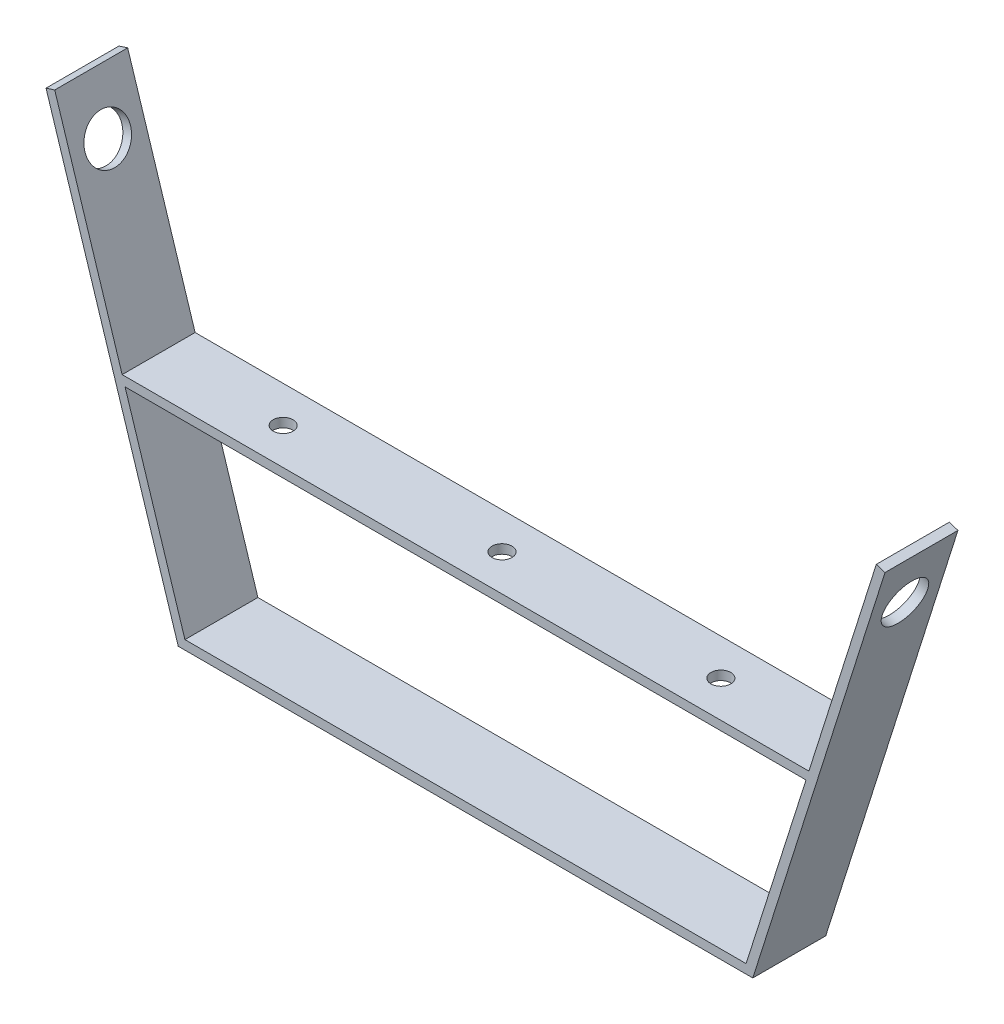
ISO-10303-21;
HEADER;
FILE_DESCRIPTION(('STEP AP214'),'2;1');
FILE_NAME('part.step','',(''),(''),'','','');
FILE_SCHEMA(('AUTOMOTIVE_DESIGN { 1 0 10303 214 1 1 1 1 }'));
ENDSEC;
DATA;
#1=APPLICATION_CONTEXT('core data for automotive mechanical design processes');
#2=APPLICATION_PROTOCOL_DEFINITION('international standard','automotive_design',2000,#1);
#3=PRODUCT_CONTEXT('',#1,'mechanical');
#4=PRODUCT('Part','Part','',(#3));
#5=PRODUCT_RELATED_PRODUCT_CATEGORY('part','',(#4));
#6=PRODUCT_DEFINITION_FORMATION('','',#4);
#7=PRODUCT_DEFINITION_CONTEXT('part definition',#1,'design');
#8=PRODUCT_DEFINITION('design','',#6,#7);
#9=PRODUCT_DEFINITION_SHAPE('','',#8);
#10=(LENGTH_UNIT() NAMED_UNIT(*) SI_UNIT(.MILLI.,.METRE.));
#11=(NAMED_UNIT(*) PLANE_ANGLE_UNIT() SI_UNIT($,.RADIAN.));
#12=(NAMED_UNIT(*) SI_UNIT($,.STERADIAN.) SOLID_ANGLE_UNIT());
#13=UNCERTAINTY_MEASURE_WITH_UNIT(LENGTH_MEASURE(1.E-05),#10,'distance_accuracy_value','');
#14=(GEOMETRIC_REPRESENTATION_CONTEXT(3) GLOBAL_UNCERTAINTY_ASSIGNED_CONTEXT((#13)) GLOBAL_UNIT_ASSIGNED_CONTEXT((#10,
#11,#12)) REPRESENTATION_CONTEXT('',''));
#15=CARTESIAN_POINT('',(0.,0.,0.));
#16=DIRECTION('',(0.,0.,1.));
#17=DIRECTION('',(1.,0.,0.));
#18=AXIS2_PLACEMENT_3D('',#15,#16,#17);
#19=CARTESIAN_POINT('',(101.785788592537,-21.2759063930494,25.4));
#20=DIRECTION('',(0.953281521756413,-0.302083333333333,0.));
#21=DIRECTION('',(0.302083333333333,0.953281521756413,0.));
#22=AXIS2_PLACEMENT_3D('',#19,#20,#21);
#23=PLANE('',#22);
#24=CARTESIAN_POINT('',(141.366413923611,103.628299116502,12.7));
#25=DIRECTION('',(0.953281521756413,-0.302083333333333,0.));
#26=DIRECTION('',(0.302083333333333,0.953281521756413,0.));
#27=AXIS2_PLACEMENT_3D('',#24,#25,#26);
#28=CIRCLE('',#27,7.93749999999999);
#29=CARTESIAN_POINT('',(143.764200381944,111.194971195443,12.7));
#30=VERTEX_POINT('',#29);
#31=EDGE_CURVE('E42',#30,#30,#28,.T.);
#32=ORIENTED_EDGE('',*,*,#31,.T.);
#33=EDGE_LOOP('',(#32));
#34=FACE_BOUND('',#33,.T.);
#35=DIRECTION('',(-0.302083333333333,-0.953281521756413,0.));
#36=VECTOR('',#35,1.);
#37=CARTESIAN_POINT('',(101.785788592537,-21.2759063930494,0.));
#38=LINE('',#37,#36);
#39=CARTESIAN_POINT('',(147.121101423611,121.788312105961,0.));
#40=VERTEX_POINT('',#39);
#41=CARTESIAN_POINT('',(123.641976423611,47.6954591089659,0.));
#42=VERTEX_POINT('',#41);
#43=EDGE_CURVE('E144',#40,#42,#38,.T.);
#44=ORIENTED_EDGE('',*,*,#43,.T.);
#45=DIRECTION('',(0.,0.,-1.));
#46=VECTOR('',#45,1.);
#47=CARTESIAN_POINT('',(123.641976423611,47.6954591089659,25.4));
#48=LINE('',#47,#46);
#49=CARTESIAN_POINT('',(123.641976423611,47.6954591089659,25.4));
#50=VERTEX_POINT('',#49);
#51=EDGE_CURVE('E173',#50,#42,#48,.T.);
#52=ORIENTED_EDGE('',*,*,#51,.F.);
#53=DIRECTION('',(-0.302083333333333,-0.953281521756413,0.));
#54=VECTOR('',#53,1.);
#55=CARTESIAN_POINT('',(101.785788592537,-21.2759063930494,25.4));
#56=LINE('',#55,#54);
#57=CARTESIAN_POINT('',(147.121101423611,121.788312105961,25.4));
#58=VERTEX_POINT('',#57);
#59=EDGE_CURVE('E205',#58,#50,#56,.T.);
#60=ORIENTED_EDGE('',*,*,#59,.F.);
#61=DIRECTION('',(0.,0.,-1.));
#62=VECTOR('',#61,1.);
#63=CARTESIAN_POINT('',(147.121101423611,121.788312105961,25.4));
#64=LINE('',#63,#62);
#65=EDGE_CURVE('E254',#58,#40,#64,.T.);
#66=ORIENTED_EDGE('',*,*,#65,.T.);
#67=EDGE_LOOP('',(#44,#52,#60,#66));
#68=FACE_BOUND('',#67,.T.);
#69=ADVANCED_FACE('F38',(#34,#68),#23,.F.);
#70=CARTESIAN_POINT('',(-93.5902480821614,-21.2759063930494,25.4));
#71=DIRECTION('',(-0.953281521756413,-0.302083333333333,0.));
#72=DIRECTION('',(0.302083333333333,-0.953281521756413,0.));
#73=AXIS2_PLACEMENT_3D('',#70,#71,#72);
#74=PLANE('',#73);
#75=CARTESIAN_POINT('',(-133.170873413236,103.628299116502,12.7));
#76=DIRECTION('',(-0.953281521756413,-0.302083333333333,0.));
#77=DIRECTION('',(0.302083333333333,-0.953281521756413,0.));
#78=AXIS2_PLACEMENT_3D('',#75,#76,#77);
#79=CIRCLE('',#78,7.9375);
#80=CARTESIAN_POINT('',(-130.773086954902,96.0616270375601,12.7));
#81=VERTEX_POINT('',#80);
#82=EDGE_CURVE('E190',#81,#81,#79,.T.);
#83=ORIENTED_EDGE('',*,*,#82,.T.);
#84=EDGE_LOOP('',(#83));
#85=FACE_BOUND('',#84,.T.);
#86=DIRECTION('',(-0.302083333333333,0.953281521756413,0.));
#87=VECTOR('',#86,1.);
#88=CARTESIAN_POINT('',(-93.5902480821614,-21.2759063930494,25.4));
#89=LINE('',#88,#87);
#90=CARTESIAN_POINT('',(-115.446435913236,47.6954591089659,25.4));
#91=VERTEX_POINT('',#90);
#92=CARTESIAN_POINT('',(-138.925560913236,121.788312105961,25.4));
#93=VERTEX_POINT('',#92);
#94=EDGE_CURVE('E56',#91,#93,#89,.T.);
#95=ORIENTED_EDGE('',*,*,#94,.F.);
#96=DIRECTION('',(0.,0.,-1.));
#97=VECTOR('',#96,1.);
#98=CARTESIAN_POINT('',(-115.446435913236,47.6954591089659,25.4));
#99=LINE('',#98,#97);
#100=CARTESIAN_POINT('',(-115.446435913236,47.6954591089659,0.));
#101=VERTEX_POINT('',#100);
#102=EDGE_CURVE('E178',#91,#101,#99,.T.);
#103=ORIENTED_EDGE('',*,*,#102,.T.);
#104=DIRECTION('',(-0.302083333333333,0.953281521756413,0.));
#105=VECTOR('',#104,1.);
#106=CARTESIAN_POINT('',(-93.5902480821614,-21.2759063930494,0.));
#107=LINE('',#106,#105);
#108=CARTESIAN_POINT('',(-138.925560913236,121.788312105961,0.));
#109=VERTEX_POINT('',#108);
#110=EDGE_CURVE('E234',#101,#109,#107,.T.);
#111=ORIENTED_EDGE('',*,*,#110,.T.);
#112=DIRECTION('',(0.,0.,-1.));
#113=VECTOR('',#112,1.);
#114=CARTESIAN_POINT('',(-138.925560913236,121.788312105961,25.4));
#115=LINE('',#114,#113);
#116=EDGE_CURVE('E243',#93,#109,#115,.T.);
#117=ORIENTED_EDGE('',*,*,#116,.F.);
#118=EDGE_LOOP('',(#95,#103,#111,#117));
#119=FACE_BOUND('',#118,.T.);
#120=ADVANCED_FACE('F268',(#85,#119),#74,.F.);
#121=CARTESIAN_POINT('',(-95.9147297448123,-24.4509063930494,25.4));
#122=DIRECTION('',(0.953281521756413,0.302083333333333,0.));
#123=DIRECTION('',(-0.302083333333333,0.953281521756413,0.));
#124=AXIS2_PLACEMENT_3D('',#121,#122,#123);
#125=PLANE('',#124);
#126=CARTESIAN_POINT('',(-136.197542244812,102.669184533168,12.7));
#127=DIRECTION('',(-0.953281521756413,-0.302083333333333,0.));
#128=DIRECTION('',(0.302083333333333,-0.953281521756413,0.));
#129=AXIS2_PLACEMENT_3D('',#126,#127,#128);
#130=CIRCLE('',#129,7.9375);
#131=CARTESIAN_POINT('',(-133.799755786479,95.1025124542268,12.7));
#132=VERTEX_POINT('',#131);
#133=EDGE_CURVE('E186',#132,#132,#130,.T.);
#134=ORIENTED_EDGE('',*,*,#133,.F.);
#135=EDGE_LOOP('',(#134));
#136=FACE_BOUND('',#135,.T.);
#137=DIRECTION('',(0.302083333333333,-0.953281521756413,0.));
#138=VECTOR('',#137,1.);
#139=CARTESIAN_POINT('',(-95.9147297448123,-24.4509063930494,0.));
#140=LINE('',#139,#138);
#141=CARTESIAN_POINT('',(-141.952229744812,120.829197522628,0.));
#142=VERTEX_POINT('',#141);
#143=CARTESIAN_POINT('',(-95.9147297448123,-24.4509063930494,0.));
#144=VERTEX_POINT('',#143);
#145=EDGE_CURVE('E219',#142,#144,#140,.T.);
#146=ORIENTED_EDGE('',*,*,#145,.T.);
#147=DIRECTION('',(0.,0.,-1.));
#148=VECTOR('',#147,1.);
#149=CARTESIAN_POINT('',(-95.9147297448123,-24.4509063930494,25.4));
#150=LINE('',#149,#148);
#151=CARTESIAN_POINT('',(-95.9147297448123,-24.4509063930494,25.4));
#152=VERTEX_POINT('',#151);
#153=EDGE_CURVE('E11',#152,#144,#150,.T.);
#154=ORIENTED_EDGE('',*,*,#153,.F.);
#155=DIRECTION('',(0.302083333333333,-0.953281521756413,0.));
#156=VECTOR('',#155,1.);
#157=CARTESIAN_POINT('',(-95.9147297448123,-24.4509063930494,25.4));
#158=LINE('',#157,#156);
#159=CARTESIAN_POINT('',(-141.952229744812,120.829197522628,25.4));
#160=VERTEX_POINT('',#159);
#161=EDGE_CURVE('E191',#160,#152,#158,.T.);
#162=ORIENTED_EDGE('',*,*,#161,.F.);
#163=DIRECTION('',(0.,0.,-1.));
#164=VECTOR('',#163,1.);
#165=CARTESIAN_POINT('',(-141.952229744812,120.829197522628,25.4));
#166=LINE('',#165,#164);
#167=EDGE_CURVE('E218',#160,#142,#166,.T.);
#168=ORIENTED_EDGE('',*,*,#167,.T.);
#169=EDGE_LOOP('',(#146,#154,#162,#168));
#170=FACE_BOUND('',#169,.T.);
#171=ADVANCED_FACE('F40',(#136,#170),#125,.F.);
#172=CARTESIAN_POINT('',(-95.9147297448123,-24.4509063930494,25.4));
#173=DIRECTION('',(0.,1.,0.));
#174=DIRECTION('',(-1.,0.,0.));
#175=AXIS2_PLACEMENT_3D('',#172,#173,#174);
#176=PLANE('',#175);
#177=DIRECTION('',(1.,0.,0.));
#178=VECTOR('',#177,1.);
#179=CARTESIAN_POINT('',(-95.9147297448123,-24.4509063930494,0.));
#180=LINE('',#179,#178);
#181=CARTESIAN_POINT('',(104.110270255188,-24.4509063930494,0.));
#182=VERTEX_POINT('',#181);
#183=EDGE_CURVE('E223',#144,#182,#180,.T.);
#184=ORIENTED_EDGE('',*,*,#183,.T.);
#185=DIRECTION('',(0.,0.,-1.));
#186=VECTOR('',#185,1.);
#187=CARTESIAN_POINT('',(104.110270255188,-24.4509063930494,25.4));
#188=LINE('',#187,#186);
#189=CARTESIAN_POINT('',(104.110270255188,-24.4509063930494,25.4));
#190=VERTEX_POINT('',#189);
#191=EDGE_CURVE('E48',#190,#182,#188,.T.);
#192=ORIENTED_EDGE('',*,*,#191,.F.);
#193=DIRECTION('',(1.,0.,0.));
#194=VECTOR('',#193,1.);
#195=CARTESIAN_POINT('',(-95.9147297448123,-24.4509063930494,25.4));
#196=LINE('',#195,#194);
#197=EDGE_CURVE('E195',#152,#190,#196,.T.);
#198=ORIENTED_EDGE('',*,*,#197,.F.);
#199=ORIENTED_EDGE('',*,*,#153,.T.);
#200=EDGE_LOOP('',(#184,#192,#198,#199));
#201=FACE_BOUND('',#200,.T.);
#202=ADVANCED_FACE('F313',(#201),#176,.F.);
#203=CARTESIAN_POINT('',(104.110270255188,-24.4509063930494,25.4));
#204=DIRECTION('',(-0.953281521756413,0.302083333333333,0.));
#205=DIRECTION('',(-0.302083333333333,-0.953281521756413,0.));
#206=AXIS2_PLACEMENT_3D('',#203,#204,#205);
#207=PLANE('',#206);
#208=CARTESIAN_POINT('',(144.393082755188,102.669184533168,12.7));
#209=DIRECTION('',(0.953281521756413,-0.302083333333333,0.));
#210=DIRECTION('',(0.302083333333333,0.953281521756413,0.));
#211=AXIS2_PLACEMENT_3D('',#208,#209,#210);
#212=CIRCLE('',#211,7.93749999999999);
#213=CARTESIAN_POINT('',(146.790869213521,110.23585661211,12.7));
#214=VERTEX_POINT('',#213);
#215=EDGE_CURVE('E177',#214,#214,#212,.T.);
#216=ORIENTED_EDGE('',*,*,#215,.F.);
#217=EDGE_LOOP('',(#216));
#218=FACE_BOUND('',#217,.T.);
#219=DIRECTION('',(0.302083333333333,0.953281521756413,0.));
#220=VECTOR('',#219,1.);
#221=CARTESIAN_POINT('',(104.110270255188,-24.4509063930494,0.));
#222=LINE('',#221,#220);
#223=CARTESIAN_POINT('',(150.147770255188,120.829197522628,0.));
#224=VERTEX_POINT('',#223);
#225=EDGE_CURVE('E226',#182,#224,#222,.T.);
#226=ORIENTED_EDGE('',*,*,#225,.T.);
#227=DIRECTION('',(0.,0.,-1.));
#228=VECTOR('',#227,1.);
#229=CARTESIAN_POINT('',(150.147770255188,120.829197522628,25.4));
#230=LINE('',#229,#228);
#231=CARTESIAN_POINT('',(150.147770255188,120.829197522628,25.4));
#232=VERTEX_POINT('',#231);
#233=EDGE_CURVE('E258',#232,#224,#230,.T.);
#234=ORIENTED_EDGE('',*,*,#233,.F.);
#235=DIRECTION('',(0.302083333333333,0.953281521756413,0.));
#236=VECTOR('',#235,1.);
#237=CARTESIAN_POINT('',(104.110270255188,-24.4509063930494,25.4));
#238=LINE('',#237,#236);
#239=EDGE_CURVE('E199',#190,#232,#238,.T.);
#240=ORIENTED_EDGE('',*,*,#239,.F.);
#241=ORIENTED_EDGE('',*,*,#191,.T.);
#242=EDGE_LOOP('',(#226,#234,#240,#241));
#243=FACE_BOUND('',#242,.T.);
#244=ADVANCED_FACE('F308',(#218,#243),#207,.F.);
#245=CARTESIAN_POINT('',(147.121101423611,121.788312105961,25.4));
#246=DIRECTION('',(-0.302083333333333,-0.953281521756413,0.));
#247=DIRECTION('',(0.953281521756413,-0.302083333333333,0.));
#248=AXIS2_PLACEMENT_3D('',#245,#246,#247);
#249=PLANE('',#248);
#250=DIRECTION('',(-0.953281521756413,0.302083333333333,0.));
#251=VECTOR('',#250,1.);
#252=CARTESIAN_POINT('',(147.121101423611,121.788312105961,0.));
#253=LINE('',#252,#251);
#254=EDGE_CURVE('E145',#224,#40,#253,.T.);
#255=ORIENTED_EDGE('',*,*,#254,.T.);
#256=ORIENTED_EDGE('',*,*,#65,.F.);
#257=DIRECTION('',(-0.953281521756413,0.302083333333333,0.));
#258=VECTOR('',#257,1.);
#259=CARTESIAN_POINT('',(147.121101423611,121.788312105961,25.4));
#260=LINE('',#259,#258);
#261=EDGE_CURVE('E202',#232,#58,#260,.T.);
#262=ORIENTED_EDGE('',*,*,#261,.F.);
#263=ORIENTED_EDGE('',*,*,#233,.T.);
#264=EDGE_LOOP('',(#255,#256,#262,#263));
#265=FACE_BOUND('',#264,.T.);
#266=ADVANCED_FACE('F301',(#265),#249,.F.);
#267=CARTESIAN_POINT('',(122.635857495001,44.5204591089659,25.4));
#268=VERTEX_POINT('',#267);
#269=CARTESIAN_POINT('',(101.785788592537,-21.2759063930494,25.4));
#270=VERTEX_POINT('',#269);
#271=EDGE_CURVE('E150',#268,#270,#56,.T.);
#272=ORIENTED_EDGE('',*,*,#271,.F.);
#273=DIRECTION('',(0.,0.,-1.));
#274=VECTOR('',#273,1.);
#275=CARTESIAN_POINT('',(122.635857495001,44.5204591089659,25.4));
#276=LINE('',#275,#274);
#277=CARTESIAN_POINT('',(122.635857495001,44.5204591089659,0.));
#278=VERTEX_POINT('',#277);
#279=EDGE_CURVE('E148',#268,#278,#276,.T.);
#280=ORIENTED_EDGE('',*,*,#279,.T.);
#281=CARTESIAN_POINT('',(101.785788592537,-21.2759063930494,0.));
#282=VERTEX_POINT('',#281);
#283=EDGE_CURVE('E132',#278,#282,#38,.T.);
#284=ORIENTED_EDGE('',*,*,#283,.T.);
#285=DIRECTION('',(0.,0.,-1.));
#286=VECTOR('',#285,1.);
#287=CARTESIAN_POINT('',(101.785788592537,-21.2759063930494,25.4));
#288=LINE('',#287,#286);
#289=EDGE_CURVE('E251',#270,#282,#288,.T.);
#290=ORIENTED_EDGE('',*,*,#289,.F.);
#291=EDGE_LOOP('',(#272,#280,#284,#290));
#292=FACE_BOUND('',#291,.T.);
#293=ADVANCED_FACE('F149',(#292),#23,.F.);
#294=CARTESIAN_POINT('',(-93.5902480821614,-21.2759063930494,25.4));
#295=DIRECTION('',(0.,-1.,0.));
#296=DIRECTION('',(0.,0.,-1.));
#297=AXIS2_PLACEMENT_3D('',#294,#295,#296);
#298=PLANE('',#297);
#299=DIRECTION('',(-1.,0.,0.));
#300=VECTOR('',#299,1.);
#301=CARTESIAN_POINT('',(-93.5902480821614,-21.2759063930494,0.));
#302=LINE('',#301,#300);
#303=CARTESIAN_POINT('',(-93.5902480821614,-21.2759063930494,0.));
#304=VERTEX_POINT('',#303);
#305=EDGE_CURVE('E139',#282,#304,#302,.T.);
#306=ORIENTED_EDGE('',*,*,#305,.T.);
#307=DIRECTION('',(0.,0.,-1.));
#308=VECTOR('',#307,1.);
#309=CARTESIAN_POINT('',(-93.5902480821614,-21.2759063930494,25.4));
#310=LINE('',#309,#308);
#311=CARTESIAN_POINT('',(-93.5902480821614,-21.2759063930494,25.4));
#312=VERTEX_POINT('',#311);
#313=EDGE_CURVE('E247',#312,#304,#310,.T.);
#314=ORIENTED_EDGE('',*,*,#313,.F.);
#315=DIRECTION('',(-1.,0.,0.));
#316=VECTOR('',#315,1.);
#317=CARTESIAN_POINT('',(-93.5902480821614,-21.2759063930494,25.4));
#318=LINE('',#317,#316);
#319=EDGE_CURVE('E209',#270,#312,#318,.T.);
#320=ORIENTED_EDGE('',*,*,#319,.F.);
#321=ORIENTED_EDGE('',*,*,#289,.T.);
#322=EDGE_LOOP('',(#306,#314,#320,#321));
#323=FACE_BOUND('',#322,.T.);
#324=ADVANCED_FACE('F300',(#323),#298,.F.);
#325=CARTESIAN_POINT('',(-114.440316984626,44.5204591089659,0.));
#326=VERTEX_POINT('',#325);
#327=EDGE_CURVE('E235',#304,#326,#107,.T.);
#328=ORIENTED_EDGE('',*,*,#327,.T.);
#329=DIRECTION('',(0.,0.,-1.));
#330=VECTOR('',#329,1.);
#331=CARTESIAN_POINT('',(-114.440316984626,44.5204591089659,25.4));
#332=LINE('',#331,#330);
#333=CARTESIAN_POINT('',(-114.440316984626,44.5204591089659,25.4));
#334=VERTEX_POINT('',#333);
#335=EDGE_CURVE('E64',#334,#326,#332,.T.);
#336=ORIENTED_EDGE('',*,*,#335,.F.);
#337=EDGE_CURVE('E212',#312,#334,#89,.T.);
#338=ORIENTED_EDGE('',*,*,#337,.F.);
#339=ORIENTED_EDGE('',*,*,#313,.T.);
#340=EDGE_LOOP('',(#328,#336,#338,#339));
#341=FACE_BOUND('',#340,.T.);
#342=ADVANCED_FACE('F294',(#341),#74,.F.);
#343=CARTESIAN_POINT('',(-141.952229744812,120.829197522628,25.4));
#344=DIRECTION('',(0.302083333333341,-0.95328152175641,0.));
#345=DIRECTION('',(0.95328152175641,0.302083333333341,0.));
#346=AXIS2_PLACEMENT_3D('',#343,#344,#345);
#347=PLANE('',#346);
#348=DIRECTION('',(-0.95328152175641,-0.302083333333341,0.));
#349=VECTOR('',#348,1.);
#350=CARTESIAN_POINT('',(-141.952229744812,120.829197522628,0.));
#351=LINE('',#350,#349);
#352=EDGE_CURVE('E196',#109,#142,#351,.T.);
#353=ORIENTED_EDGE('',*,*,#352,.T.);
#354=ORIENTED_EDGE('',*,*,#167,.F.);
#355=DIRECTION('',(-0.95328152175641,-0.302083333333341,0.));
#356=VECTOR('',#355,1.);
#357=CARTESIAN_POINT('',(-141.952229744812,120.829197522628,25.4));
#358=LINE('',#357,#356);
#359=EDGE_CURVE('E215',#93,#160,#358,.T.);
#360=ORIENTED_EDGE('',*,*,#359,.F.);
#361=ORIENTED_EDGE('',*,*,#116,.T.);
#362=EDGE_LOOP('',(#353,#354,#360,#361));
#363=FACE_BOUND('',#362,.T.);
#364=ADVANCED_FACE('F426',(#363),#347,.F.);
#365=CARTESIAN_POINT('',(0.,0.,25.4));
#366=DIRECTION('',(0.,0.,-1.));
#367=DIRECTION('',(-1.,0.,0.));
#368=AXIS2_PLACEMENT_3D('',#365,#366,#367);
#369=PLANE('',#368);
#370=DIRECTION('',(-1.,0.,0.));
#371=VECTOR('',#370,1.);
#372=CARTESIAN_POINT('',(122.635857495001,44.5204591089659,25.4));
#373=LINE('',#372,#371);
#374=EDGE_CURVE('E165',#268,#334,#373,.T.);
#375=ORIENTED_EDGE('',*,*,#374,.F.);
#376=ORIENTED_EDGE('',*,*,#271,.T.);
#377=ORIENTED_EDGE('',*,*,#319,.T.);
#378=ORIENTED_EDGE('',*,*,#337,.T.);
#379=EDGE_LOOP('',(#375,#376,#377,#378));
#380=FACE_BOUND('',#379,.T.);
#381=ORIENTED_EDGE('',*,*,#161,.T.);
#382=ORIENTED_EDGE('',*,*,#197,.T.);
#383=ORIENTED_EDGE('',*,*,#239,.T.);
#384=ORIENTED_EDGE('',*,*,#261,.T.);
#385=ORIENTED_EDGE('',*,*,#59,.T.);
#386=DIRECTION('',(1.,0.,0.));
#387=VECTOR('',#386,1.);
#388=CARTESIAN_POINT('',(123.641976423611,47.6954591089659,25.4));
#389=LINE('',#388,#387);
#390=EDGE_CURVE('E155',#91,#50,#389,.T.);
#391=ORIENTED_EDGE('',*,*,#390,.F.);
#392=ORIENTED_EDGE('',*,*,#94,.T.);
#393=ORIENTED_EDGE('',*,*,#359,.T.);
#394=EDGE_LOOP('',(#381,#382,#383,#384,#385,#391,#392,#393));
#395=FACE_BOUND('',#394,.T.);
#396=ADVANCED_FACE('F283',(#380,#395),#369,.F.);
#397=CARTESIAN_POINT('',(0.,0.,0.));
#398=DIRECTION('',(0.,0.,-1.));
#399=DIRECTION('',(-1.,0.,0.));
#400=AXIS2_PLACEMENT_3D('',#397,#398,#399);
#401=PLANE('',#400);
#402=ORIENTED_EDGE('',*,*,#283,.F.);
#403=DIRECTION('',(-1.,0.,0.));
#404=VECTOR('',#403,1.);
#405=CARTESIAN_POINT('',(122.635857495001,44.5204591089659,0.));
#406=LINE('',#405,#404);
#407=EDGE_CURVE('E138',#278,#326,#406,.T.);
#408=ORIENTED_EDGE('',*,*,#407,.T.);
#409=ORIENTED_EDGE('',*,*,#327,.F.);
#410=ORIENTED_EDGE('',*,*,#305,.F.);
#411=EDGE_LOOP('',(#402,#408,#409,#410));
#412=FACE_BOUND('',#411,.T.);
#413=ORIENTED_EDGE('',*,*,#145,.F.);
#414=ORIENTED_EDGE('',*,*,#352,.F.);
#415=ORIENTED_EDGE('',*,*,#110,.F.);
#416=DIRECTION('',(1.,0.,0.));
#417=VECTOR('',#416,1.);
#418=CARTESIAN_POINT('',(123.641976423611,47.6954591089659,0.));
#419=LINE('',#418,#417);
#420=EDGE_CURVE('E159',#101,#42,#419,.T.);
#421=ORIENTED_EDGE('',*,*,#420,.T.);
#422=ORIENTED_EDGE('',*,*,#43,.F.);
#423=ORIENTED_EDGE('',*,*,#254,.F.);
#424=ORIENTED_EDGE('',*,*,#225,.F.);
#425=ORIENTED_EDGE('',*,*,#183,.F.);
#426=EDGE_LOOP('',(#413,#414,#415,#421,#422,#423,#424,#425));
#427=FACE_BOUND('',#426,.T.);
#428=ADVANCED_FACE('F134',(#412,#427),#401,.T.);
#429=CARTESIAN_POINT('',(-111.984191592199,110.342101199835,12.7));
#430=DIRECTION('',(-0.953281521756413,-0.302083333333333,0.));
#431=DIRECTION('',(0.302083333333333,-0.953281521756413,0.));
#432=AXIS2_PLACEMENT_3D('',#429,#430,#431);
#433=CYLINDRICAL_SURFACE('',#432,7.9375);
#434=ORIENTED_EDGE('',*,*,#133,.T.);
#435=EDGE_LOOP('',(#434));
#436=FACE_BOUND('',#435,.T.);
#437=ORIENTED_EDGE('',*,*,#82,.F.);
#438=EDGE_LOOP('',(#437));
#439=FACE_BOUND('',#438,.T.);
#440=ADVANCED_FACE('F270',(#436,#439),#433,.F.);
#441=CARTESIAN_POINT('',(120.179732102575,110.342101199835,12.7));
#442=DIRECTION('',(0.953281521756413,-0.302083333333333,0.));
#443=DIRECTION('',(0.302083333333333,0.953281521756413,0.));
#444=AXIS2_PLACEMENT_3D('',#441,#442,#443);
#445=CYLINDRICAL_SURFACE('',#444,7.93749999999999);
#446=ORIENTED_EDGE('',*,*,#215,.T.);
#447=EDGE_LOOP('',(#446));
#448=FACE_BOUND('',#447,.T.);
#449=ORIENTED_EDGE('',*,*,#31,.F.);
#450=EDGE_LOOP('',(#449));
#451=FACE_BOUND('',#450,.T.);
#452=ADVANCED_FACE('F272',(#448,#451),#445,.F.);
#453=CARTESIAN_POINT('',(123.641976423611,47.6954591089659,25.4));
#454=DIRECTION('',(0.,1.,0.));
#455=DIRECTION('',(0.,0.,1.));
#456=AXIS2_PLACEMENT_3D('',#453,#454,#455);
#457=PLANE('',#456);
#458=CARTESIAN_POINT('',(-72.1030235763889,47.6954591089659,12.7));
#459=DIRECTION('',(0.,1.,0.));
#460=DIRECTION('',(0.,0.,1.));
#461=AXIS2_PLACEMENT_3D('',#458,#459,#460);
#462=CIRCLE('',#461,3.45761573410799);
#463=CARTESIAN_POINT('',(-72.1030235763889,47.6954591089659,16.157615734108));
#464=VERTEX_POINT('',#463);
#465=EDGE_CURVE('E168',#464,#464,#462,.T.);
#466=ORIENTED_EDGE('',*,*,#465,.F.);
#467=EDGE_LOOP('',(#466));
#468=FACE_BOUND('',#467,.T.);
#469=CARTESIAN_POINT('',(4.09697642361111,47.6954591089659,12.7));
#470=DIRECTION('',(0.,1.,0.));
#471=DIRECTION('',(0.,0.,1.));
#472=AXIS2_PLACEMENT_3D('',#469,#470,#471);
#473=CIRCLE('',#472,3.457615734108);
#474=CARTESIAN_POINT('',(4.09697642361111,47.6954591089659,16.157615734108));
#475=VERTEX_POINT('',#474);
#476=EDGE_CURVE('E350',#475,#475,#473,.T.);
#477=ORIENTED_EDGE('',*,*,#476,.F.);
#478=EDGE_LOOP('',(#477));
#479=FACE_BOUND('',#478,.T.);
#480=CARTESIAN_POINT('',(80.2969764236111,47.6954591089659,12.7));
#481=DIRECTION('',(0.,1.,0.));
#482=DIRECTION('',(0.,0.,1.));
#483=AXIS2_PLACEMENT_3D('',#480,#481,#482);
#484=CIRCLE('',#483,3.45761573410801);
#485=CARTESIAN_POINT('',(80.2969764236111,47.6954591089659,16.157615734108));
#486=VERTEX_POINT('',#485);
#487=EDGE_CURVE('E342',#486,#486,#484,.T.);
#488=ORIENTED_EDGE('',*,*,#487,.F.);
#489=EDGE_LOOP('',(#488));
#490=FACE_BOUND('',#489,.T.);
#491=ORIENTED_EDGE('',*,*,#420,.F.);
#492=ORIENTED_EDGE('',*,*,#102,.F.);
#493=ORIENTED_EDGE('',*,*,#390,.T.);
#494=ORIENTED_EDGE('',*,*,#51,.T.);
#495=EDGE_LOOP('',(#491,#492,#493,#494));
#496=FACE_BOUND('',#495,.T.);
#497=ADVANCED_FACE('F279',(#468,#479,#490,#496),#457,.T.);
#498=CARTESIAN_POINT('',(122.635857495001,44.5204591089659,25.4));
#499=DIRECTION('',(0.,-1.,0.));
#500=DIRECTION('',(0.,0.,-1.));
#501=AXIS2_PLACEMENT_3D('',#498,#499,#500);
#502=PLANE('',#501);
#503=CARTESIAN_POINT('',(-72.1030235763889,44.5204591089659,12.7));
#504=DIRECTION('',(0.,1.,0.));
#505=DIRECTION('',(0.,0.,1.));
#506=AXIS2_PLACEMENT_3D('',#503,#504,#505);
#507=CIRCLE('',#506,3.45761573410799);
#508=CARTESIAN_POINT('',(-72.1030235763889,44.5204591089659,16.157615734108));
#509=VERTEX_POINT('',#508);
#510=EDGE_CURVE('E160',#509,#509,#507,.T.);
#511=ORIENTED_EDGE('',*,*,#510,.T.);
#512=EDGE_LOOP('',(#511));
#513=FACE_BOUND('',#512,.T.);
#514=CARTESIAN_POINT('',(4.09697642361111,44.5204591089659,12.7));
#515=DIRECTION('',(0.,1.,0.));
#516=DIRECTION('',(0.,0.,1.));
#517=AXIS2_PLACEMENT_3D('',#514,#515,#516);
#518=CIRCLE('',#517,3.457615734108);
#519=CARTESIAN_POINT('',(4.09697642361111,44.5204591089659,16.157615734108));
#520=VERTEX_POINT('',#519);
#521=EDGE_CURVE('E354',#520,#520,#518,.T.);
#522=ORIENTED_EDGE('',*,*,#521,.T.);
#523=EDGE_LOOP('',(#522));
#524=FACE_BOUND('',#523,.T.);
#525=CARTESIAN_POINT('',(80.2969764236111,44.5204591089659,12.7));
#526=DIRECTION('',(0.,1.,0.));
#527=DIRECTION('',(0.,0.,1.));
#528=AXIS2_PLACEMENT_3D('',#525,#526,#527);
#529=CIRCLE('',#528,3.45761573410801);
#530=CARTESIAN_POINT('',(80.2969764236111,44.5204591089659,16.157615734108));
#531=VERTEX_POINT('',#530);
#532=EDGE_CURVE('E346',#531,#531,#529,.T.);
#533=ORIENTED_EDGE('',*,*,#532,.T.);
#534=EDGE_LOOP('',(#533));
#535=FACE_BOUND('',#534,.T.);
#536=ORIENTED_EDGE('',*,*,#407,.F.);
#537=ORIENTED_EDGE('',*,*,#279,.F.);
#538=ORIENTED_EDGE('',*,*,#374,.T.);
#539=ORIENTED_EDGE('',*,*,#335,.T.);
#540=EDGE_LOOP('',(#536,#537,#538,#539));
#541=FACE_BOUND('',#540,.T.);
#542=ADVANCED_FACE('F157',(#513,#524,#535,#541),#502,.T.);
#543=CARTESIAN_POINT('',(80.2969764236111,44.5204591089659,12.7));
#544=DIRECTION('',(0.,1.,0.));
#545=DIRECTION('',(0.,0.,1.));
#546=AXIS2_PLACEMENT_3D('',#543,#544,#545);
#547=CYLINDRICAL_SURFACE('',#546,3.45761573410801);
#548=ORIENTED_EDGE('',*,*,#532,.F.);
#549=EDGE_LOOP('',(#548));
#550=FACE_BOUND('',#549,.T.);
#551=ORIENTED_EDGE('',*,*,#487,.T.);
#552=EDGE_LOOP('',(#551));
#553=FACE_BOUND('',#552,.T.);
#554=ADVANCED_FACE('F371',(#550,#553),#547,.F.);
#555=CARTESIAN_POINT('',(4.09697642361111,44.5204591089659,12.7));
#556=DIRECTION('',(0.,1.,0.));
#557=DIRECTION('',(0.,0.,1.));
#558=AXIS2_PLACEMENT_3D('',#555,#556,#557);
#559=CYLINDRICAL_SURFACE('',#558,3.457615734108);
#560=ORIENTED_EDGE('',*,*,#521,.F.);
#561=EDGE_LOOP('',(#560));
#562=FACE_BOUND('',#561,.T.);
#563=ORIENTED_EDGE('',*,*,#476,.T.);
#564=EDGE_LOOP('',(#563));
#565=FACE_BOUND('',#564,.T.);
#566=ADVANCED_FACE('F373',(#562,#565),#559,.F.);
#567=CARTESIAN_POINT('',(-72.1030235763889,44.5204591089659,12.7));
#568=DIRECTION('',(0.,1.,0.));
#569=DIRECTION('',(0.,0.,1.));
#570=AXIS2_PLACEMENT_3D('',#567,#568,#569);
#571=CYLINDRICAL_SURFACE('',#570,3.45761573410799);
#572=ORIENTED_EDGE('',*,*,#510,.F.);
#573=EDGE_LOOP('',(#572));
#574=FACE_BOUND('',#573,.T.);
#575=ORIENTED_EDGE('',*,*,#465,.T.);
#576=EDGE_LOOP('',(#575));
#577=FACE_BOUND('',#576,.T.);
#578=ADVANCED_FACE('F362',(#574,#577),#571,.F.);
#579=CLOSED_SHELL('',(#69,#120,#171,#202,#244,#266,#293,#324,#342,#364,#396,#428,#440,#452,#497,
#542,#554,#566,#578));
#580=MANIFOLD_SOLID_BREP('B2',#579);
#581=ADVANCED_BREP_SHAPE_REPRESENTATION('',(#18,#580),#14);
#582=SHAPE_DEFINITION_REPRESENTATION(#9,#581);
ENDSEC;
END-ISO-10303-21;
